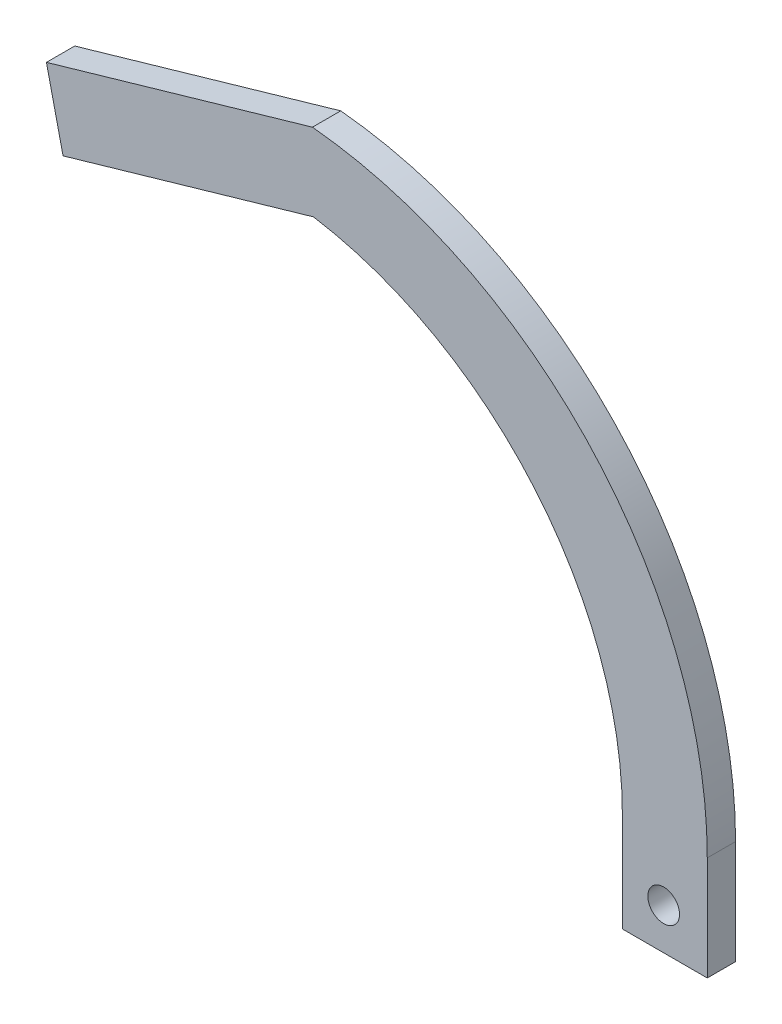
ISO-10303-21;
HEADER;
FILE_DESCRIPTION(('STEP AP214'),'2;1');
FILE_NAME('part.step','',(''),(''),'','','');
FILE_SCHEMA(('AUTOMOTIVE_DESIGN { 1 0 10303 214 1 1 1 1 }'));
ENDSEC;
DATA;
#1=APPLICATION_CONTEXT('core data for automotive mechanical design processes');
#2=APPLICATION_PROTOCOL_DEFINITION('international standard','automotive_design',2000,#1);
#3=PRODUCT_CONTEXT('',#1,'mechanical');
#4=PRODUCT('Part','Part','',(#3));
#5=PRODUCT_RELATED_PRODUCT_CATEGORY('part','',(#4));
#6=PRODUCT_DEFINITION_FORMATION('','',#4);
#7=PRODUCT_DEFINITION_CONTEXT('part definition',#1,'design');
#8=PRODUCT_DEFINITION('design','',#6,#7);
#9=PRODUCT_DEFINITION_SHAPE('','',#8);
#10=(LENGTH_UNIT() NAMED_UNIT(*) SI_UNIT(.MILLI.,.METRE.));
#11=(NAMED_UNIT(*) PLANE_ANGLE_UNIT() SI_UNIT($,.RADIAN.));
#12=(NAMED_UNIT(*) SI_UNIT($,.STERADIAN.) SOLID_ANGLE_UNIT());
#13=UNCERTAINTY_MEASURE_WITH_UNIT(LENGTH_MEASURE(1.E-05),#10,'distance_accuracy_value','');
#14=(GEOMETRIC_REPRESENTATION_CONTEXT(3) GLOBAL_UNCERTAINTY_ASSIGNED_CONTEXT((#13)) GLOBAL_UNIT_ASSIGNED_CONTEXT((#10,
#11,#12)) REPRESENTATION_CONTEXT('',''));
#15=CARTESIAN_POINT('',(0.,0.,0.));
#16=DIRECTION('',(0.,0.,1.));
#17=DIRECTION('',(1.,0.,0.));
#18=AXIS2_PLACEMENT_3D('',#15,#16,#17);
#19=CARTESIAN_POINT('',(-116.627264147549,44.7987217082872,2.54));
#20=DIRECTION('',(0.,0.,-1.));
#21=DIRECTION('',(-1.,0.,0.));
#22=AXIS2_PLACEMENT_3D('',#19,#20,#21);
#23=CYLINDRICAL_SURFACE('',#22,66.0594790028803);
#24=CARTESIAN_POINT('',(-116.627264147549,44.7987217082872,-2.54));
#25=DIRECTION('',(0.,0.,-1.));
#26=DIRECTION('',(1.,0.,0.));
#27=AXIS2_PLACEMENT_3D('',#24,#25,#26);
#28=CIRCLE('',#27,66.0594790028803);
#29=CARTESIAN_POINT('',(-106.007662429317,109.999019449004,-2.54));
#30=VERTEX_POINT('',#29);
#31=CARTESIAN_POINT('',(-50.5677851446684,44.7987217082872,-2.54));
#32=VERTEX_POINT('',#31);
#33=EDGE_CURVE('E128',#30,#32,#28,.T.);
#34=ORIENTED_EDGE('',*,*,#33,.T.);
#35=DIRECTION('',(0.,0.,-1.));
#36=VECTOR('',#35,1.);
#37=CARTESIAN_POINT('',(-50.5677851446684,44.7987217082872,2.54));
#38=LINE('',#37,#36);
#39=CARTESIAN_POINT('',(-50.5677851446684,44.7987217082872,2.54));
#40=VERTEX_POINT('',#39);
#41=EDGE_CURVE('E11',#40,#32,#38,.T.);
#42=ORIENTED_EDGE('',*,*,#41,.F.);
#43=CARTESIAN_POINT('',(-116.627264147549,44.7987217082872,2.54));
#44=DIRECTION('',(0.,0.,-1.));
#45=DIRECTION('',(1.,0.,0.));
#46=AXIS2_PLACEMENT_3D('',#43,#44,#45);
#47=CIRCLE('',#46,66.0594790028803);
#48=CARTESIAN_POINT('',(-106.007662429317,109.999019449004,2.54));
#49=VERTEX_POINT('',#48);
#50=EDGE_CURVE('E143',#49,#40,#47,.T.);
#51=ORIENTED_EDGE('',*,*,#50,.F.);
#52=DIRECTION('',(0.,0.,-1.));
#53=VECTOR('',#52,1.);
#54=CARTESIAN_POINT('',(-106.007662429317,109.999019449004,2.54));
#55=LINE('',#54,#53);
#56=EDGE_CURVE('E124',#49,#30,#55,.T.);
#57=ORIENTED_EDGE('',*,*,#56,.T.);
#58=EDGE_LOOP('',(#34,#42,#51,#57));
#59=FACE_BOUND('',#58,.T.);
#60=ADVANCED_FACE('F32',(#59),#23,.F.);
#61=CARTESIAN_POINT('',(-50.5677851446684,44.7987217082872,2.54));
#62=DIRECTION('',(1.,0.,0.));
#63=DIRECTION('',(0.,0.,-1.));
#64=AXIS2_PLACEMENT_3D('',#61,#62,#63);
#65=PLANE('',#64);
#66=DIRECTION('',(0.,-1.,0.));
#67=VECTOR('',#66,1.);
#68=CARTESIAN_POINT('',(-50.5677851446684,44.7987217082872,-2.54));
#69=LINE('',#68,#67);
#70=CARTESIAN_POINT('',(-50.5677851446684,27.0187217082872,-2.54));
#71=VERTEX_POINT('',#70);
#72=EDGE_CURVE('E131',#32,#71,#69,.T.);
#73=ORIENTED_EDGE('',*,*,#72,.T.);
#74=DIRECTION('',(0.,0.,-1.));
#75=VECTOR('',#74,1.);
#76=CARTESIAN_POINT('',(-50.5677851446684,27.0187217082872,2.54));
#77=LINE('',#76,#75);
#78=CARTESIAN_POINT('',(-50.5677851446684,27.0187217082872,2.54));
#79=VERTEX_POINT('',#78);
#80=EDGE_CURVE('E40',#79,#71,#77,.T.);
#81=ORIENTED_EDGE('',*,*,#80,.F.);
#82=DIRECTION('',(0.,-1.,0.));
#83=VECTOR('',#82,1.);
#84=CARTESIAN_POINT('',(-50.5677851446684,44.7987217082872,2.54));
#85=LINE('',#84,#83);
#86=EDGE_CURVE('E91',#40,#79,#85,.T.);
#87=ORIENTED_EDGE('',*,*,#86,.F.);
#88=ORIENTED_EDGE('',*,*,#41,.T.);
#89=EDGE_LOOP('',(#73,#81,#87,#88));
#90=FACE_BOUND('',#89,.T.);
#91=ADVANCED_FACE('F196',(#90),#65,.F.);
#92=CARTESIAN_POINT('',(-50.5677851446684,27.0187217082872,2.54));
#93=DIRECTION('',(0.,1.,0.));
#94=DIRECTION('',(-1.,0.,0.));
#95=AXIS2_PLACEMENT_3D('',#92,#93,#94);
#96=PLANE('',#95);
#97=DIRECTION('',(1.,0.,0.));
#98=VECTOR('',#97,1.);
#99=CARTESIAN_POINT('',(-50.5677851446684,27.0187217082872,-2.54));
#100=LINE('',#99,#98);
#101=CARTESIAN_POINT('',(-35.3277851446683,27.0187217082872,-2.54));
#102=VERTEX_POINT('',#101);
#103=EDGE_CURVE('E134',#71,#102,#100,.T.);
#104=ORIENTED_EDGE('',*,*,#103,.T.);
#105=DIRECTION('',(0.,0.,-1.));
#106=VECTOR('',#105,1.);
#107=CARTESIAN_POINT('',(-35.3277851446683,27.0187217082872,2.54));
#108=LINE('',#107,#106);
#109=CARTESIAN_POINT('',(-35.3277851446683,27.0187217082872,2.54));
#110=VERTEX_POINT('',#109);
#111=EDGE_CURVE('E150',#110,#102,#108,.T.);
#112=ORIENTED_EDGE('',*,*,#111,.F.);
#113=DIRECTION('',(1.,0.,0.));
#114=VECTOR('',#113,1.);
#115=CARTESIAN_POINT('',(-50.5677851446684,27.0187217082872,2.54));
#116=LINE('',#115,#114);
#117=EDGE_CURVE('E158',#79,#110,#116,.T.);
#118=ORIENTED_EDGE('',*,*,#117,.F.);
#119=ORIENTED_EDGE('',*,*,#80,.T.);
#120=EDGE_LOOP('',(#104,#112,#118,#119));
#121=FACE_BOUND('',#120,.T.);
#122=ADVANCED_FACE('F156',(#121),#96,.F.);
#123=CARTESIAN_POINT('',(-35.3277851446683,45.6916525978471,2.54));
#124=DIRECTION('',(-1.,0.,0.));
#125=DIRECTION('',(0.,0.,1.));
#126=AXIS2_PLACEMENT_3D('',#123,#124,#125);
#127=PLANE('',#126);
#128=DIRECTION('',(0.,1.,0.));
#129=VECTOR('',#128,1.);
#130=CARTESIAN_POINT('',(-35.3277851446683,45.6916525978471,-2.54));
#131=LINE('',#130,#129);
#132=CARTESIAN_POINT('',(-35.3277851446683,45.6916525978471,-2.54));
#133=VERTEX_POINT('',#132);
#134=EDGE_CURVE('E136',#102,#133,#131,.T.);
#135=ORIENTED_EDGE('',*,*,#134,.T.);
#136=DIRECTION('',(0.,0.,-1.));
#137=VECTOR('',#136,1.);
#138=CARTESIAN_POINT('',(-35.3277851446683,45.6916525978471,2.54));
#139=LINE('',#138,#137);
#140=CARTESIAN_POINT('',(-35.3277851446683,45.6916525978471,2.54));
#141=VERTEX_POINT('',#140);
#142=EDGE_CURVE('E147',#141,#133,#139,.T.);
#143=ORIENTED_EDGE('',*,*,#142,.F.);
#144=DIRECTION('',(0.,1.,0.));
#145=VECTOR('',#144,1.);
#146=CARTESIAN_POINT('',(-35.3277851446683,45.6916525978471,2.54));
#147=LINE('',#146,#145);
#148=EDGE_CURVE('E170',#110,#141,#147,.T.);
#149=ORIENTED_EDGE('',*,*,#148,.F.);
#150=ORIENTED_EDGE('',*,*,#111,.T.);
#151=EDGE_LOOP('',(#135,#143,#149,#150));
#152=FACE_BOUND('',#151,.T.);
#153=ADVANCED_FACE('F166',(#152),#127,.F.);
#154=CARTESIAN_POINT('',(-113.863218923311,45.6916525978471,2.54));
#155=DIRECTION('',(0.,0.,-1.));
#156=DIRECTION('',(-1.,0.,0.));
#157=AXIS2_PLACEMENT_3D('',#154,#155,#156);
#158=CYLINDRICAL_SURFACE('',#157,78.5354337786425);
#159=CARTESIAN_POINT('',(-113.863218923311,45.6916525978471,-2.54));
#160=DIRECTION('',(0.,0.,1.));
#161=DIRECTION('',(1.,0.,0.));
#162=AXIS2_PLACEMENT_3D('',#159,#160,#161);
#163=CIRCLE('',#162,78.5354337786425);
#164=CARTESIAN_POINT('',(-106.203198828143,123.852630399696,-2.54));
#165=VERTEX_POINT('',#164);
#166=EDGE_CURVE('E138',#133,#165,#163,.T.);
#167=ORIENTED_EDGE('',*,*,#166,.T.);
#168=DIRECTION('',(0.,0.,-1.));
#169=VECTOR('',#168,1.);
#170=CARTESIAN_POINT('',(-106.203198828143,123.852630399696,2.54));
#171=LINE('',#170,#169);
#172=CARTESIAN_POINT('',(-106.203198828143,123.852630399696,2.54));
#173=VERTEX_POINT('',#172);
#174=EDGE_CURVE('E119',#173,#165,#171,.T.);
#175=ORIENTED_EDGE('',*,*,#174,.F.);
#176=CARTESIAN_POINT('',(-113.863218923311,45.6916525978471,2.54));
#177=DIRECTION('',(0.,0.,1.));
#178=DIRECTION('',(1.,0.,0.));
#179=AXIS2_PLACEMENT_3D('',#176,#177,#178);
#180=CIRCLE('',#179,78.5354337786425);
#181=EDGE_CURVE('E110',#141,#173,#180,.T.);
#182=ORIENTED_EDGE('',*,*,#181,.F.);
#183=ORIENTED_EDGE('',*,*,#142,.T.);
#184=EDGE_LOOP('',(#167,#175,#182,#183));
#185=FACE_BOUND('',#184,.T.);
#186=ADVANCED_FACE('F169',(#185),#158,.T.);
#187=CARTESIAN_POINT('',(-106.203198828143,123.852630399696,2.54));
#188=DIRECTION('',(0.277590241332078,-0.960699566939217,0.));
#189=DIRECTION('',(0.960699566939217,0.277590241332078,0.));
#190=AXIS2_PLACEMENT_3D('',#187,#188,#189);
#191=PLANE('',#190);
#192=DIRECTION('',(-0.960699566939217,-0.277590241332078,0.));
#193=VECTOR('',#192,1.);
#194=CARTESIAN_POINT('',(-106.203198828143,123.852630399696,-2.54));
#195=LINE('',#194,#193);
#196=CARTESIAN_POINT('',(-153.95636253686,110.054547529204,-2.54));
#197=VERTEX_POINT('',#196);
#198=EDGE_CURVE('E118',#165,#197,#195,.T.);
#199=ORIENTED_EDGE('',*,*,#198,.T.);
#200=DIRECTION('',(0.,0.,-1.));
#201=VECTOR('',#200,1.);
#202=CARTESIAN_POINT('',(-153.95636253686,110.054547529204,2.54));
#203=LINE('',#202,#201);
#204=CARTESIAN_POINT('',(-153.95636253686,110.054547529204,2.54));
#205=VERTEX_POINT('',#204);
#206=EDGE_CURVE('E115',#205,#197,#203,.T.);
#207=ORIENTED_EDGE('',*,*,#206,.F.);
#208=DIRECTION('',(-0.960699566939217,-0.277590241332078,0.));
#209=VECTOR('',#208,1.);
#210=CARTESIAN_POINT('',(-106.203198828143,123.852630399696,2.54));
#211=LINE('',#210,#209);
#212=EDGE_CURVE('E104',#173,#205,#211,.T.);
#213=ORIENTED_EDGE('',*,*,#212,.F.);
#214=ORIENTED_EDGE('',*,*,#174,.T.);
#215=EDGE_LOOP('',(#199,#207,#213,#214));
#216=FACE_BOUND('',#215,.T.);
#217=ADVANCED_FACE('F116',(#216),#191,.F.);
#218=CARTESIAN_POINT('',(-150.972399127608,97.0066412476908,2.54));
#219=DIRECTION('',(0.974832779704421,0.222937326649785,0.));
#220=DIRECTION('',(-0.222937326649785,0.97483277970442,0.));
#221=AXIS2_PLACEMENT_3D('',#218,#219,#220);
#222=PLANE('',#221);
#223=DIRECTION('',(0.222937326649785,-0.97483277970442,0.));
#224=VECTOR('',#223,1.);
#225=CARTESIAN_POINT('',(-150.972399127608,97.0066412476908,-2.54));
#226=LINE('',#225,#224);
#227=CARTESIAN_POINT('',(-150.972399127608,97.0066412476908,-2.54));
#228=VERTEX_POINT('',#227);
#229=EDGE_CURVE('E77',#197,#228,#226,.T.);
#230=ORIENTED_EDGE('',*,*,#229,.T.);
#231=DIRECTION('',(0.,0.,-1.));
#232=VECTOR('',#231,1.);
#233=CARTESIAN_POINT('',(-150.972399127608,97.0066412476908,2.54));
#234=LINE('',#233,#232);
#235=CARTESIAN_POINT('',(-150.972399127608,97.0066412476908,2.54));
#236=VERTEX_POINT('',#235);
#237=EDGE_CURVE('E120',#236,#228,#234,.T.);
#238=ORIENTED_EDGE('',*,*,#237,.F.);
#239=DIRECTION('',(0.222937326649785,-0.97483277970442,0.));
#240=VECTOR('',#239,1.);
#241=CARTESIAN_POINT('',(-150.972399127608,97.0066412476908,2.54));
#242=LINE('',#241,#240);
#243=EDGE_CURVE('E108',#205,#236,#242,.T.);
#244=ORIENTED_EDGE('',*,*,#243,.F.);
#245=ORIENTED_EDGE('',*,*,#206,.T.);
#246=EDGE_LOOP('',(#230,#238,#244,#245));
#247=FACE_BOUND('',#246,.T.);
#248=ADVANCED_FACE('F122',(#247),#222,.F.);
#249=CARTESIAN_POINT('',(-106.007662429317,109.999019449004,2.54));
#250=DIRECTION('',(-0.277590241332078,0.960699566939217,0.));
#251=DIRECTION('',(-0.960699566939217,-0.277590241332078,0.));
#252=AXIS2_PLACEMENT_3D('',#249,#250,#251);
#253=PLANE('',#252);
#254=DIRECTION('',(0.960699566939217,0.277590241332078,0.));
#255=VECTOR('',#254,1.);
#256=CARTESIAN_POINT('',(-106.007662429317,109.999019449004,-2.54));
#257=LINE('',#256,#255);
#258=EDGE_CURVE('E83',#228,#30,#257,.T.);
#259=ORIENTED_EDGE('',*,*,#258,.T.);
#260=ORIENTED_EDGE('',*,*,#56,.F.);
#261=DIRECTION('',(0.960699566939217,0.277590241332078,0.));
#262=VECTOR('',#261,1.);
#263=CARTESIAN_POINT('',(-106.007662429317,109.999019449004,2.54));
#264=LINE('',#263,#262);
#265=EDGE_CURVE('E48',#236,#49,#264,.T.);
#266=ORIENTED_EDGE('',*,*,#265,.F.);
#267=ORIENTED_EDGE('',*,*,#237,.T.);
#268=EDGE_LOOP('',(#259,#260,#266,#267));
#269=FACE_BOUND('',#268,.T.);
#270=ADVANCED_FACE('F185',(#269),#253,.F.);
#271=CARTESIAN_POINT('',(-116.627264147549,44.7987217082872,2.54));
#272=DIRECTION('',(0.,0.,1.));
#273=DIRECTION('',(1.,0.,0.));
#274=AXIS2_PLACEMENT_3D('',#271,#272,#273);
#275=PLANE('',#274);
#276=CARTESIAN_POINT('',(-43.152202961565,34.4122443605378,2.54));
#277=DIRECTION('',(0.,0.,1.));
#278=DIRECTION('',(1.,0.,0.));
#279=AXIS2_PLACEMENT_3D('',#276,#277,#278);
#280=CIRCLE('',#279,2.8448);
#281=CARTESIAN_POINT('',(-40.307402961565,34.4122443605378,2.54));
#282=VERTEX_POINT('',#281);
#283=EDGE_CURVE('E178',#282,#282,#280,.T.);
#284=ORIENTED_EDGE('',*,*,#283,.F.);
#285=EDGE_LOOP('',(#284));
#286=FACE_BOUND('',#285,.T.);
#287=ORIENTED_EDGE('',*,*,#50,.T.);
#288=ORIENTED_EDGE('',*,*,#86,.T.);
#289=ORIENTED_EDGE('',*,*,#117,.T.);
#290=ORIENTED_EDGE('',*,*,#148,.T.);
#291=ORIENTED_EDGE('',*,*,#181,.T.);
#292=ORIENTED_EDGE('',*,*,#212,.T.);
#293=ORIENTED_EDGE('',*,*,#243,.T.);
#294=ORIENTED_EDGE('',*,*,#265,.T.);
#295=EDGE_LOOP('',(#287,#288,#289,#290,#291,#292,#293,#294));
#296=FACE_BOUND('',#295,.T.);
#297=ADVANCED_FACE('F106',(#286,#296),#275,.T.);
#298=CARTESIAN_POINT('',(-116.627264147549,44.7987217082872,-2.54));
#299=DIRECTION('',(0.,0.,1.));
#300=DIRECTION('',(1.,0.,0.));
#301=AXIS2_PLACEMENT_3D('',#298,#299,#300);
#302=PLANE('',#301);
#303=CARTESIAN_POINT('',(-43.152202961565,34.4122443605378,-2.54));
#304=DIRECTION('',(0.,0.,1.));
#305=DIRECTION('',(1.,0.,0.));
#306=AXIS2_PLACEMENT_3D('',#303,#304,#305);
#307=CIRCLE('',#306,2.8448);
#308=CARTESIAN_POINT('',(-40.307402961565,34.4122443605378,-2.54));
#309=VERTEX_POINT('',#308);
#310=EDGE_CURVE('E132',#309,#309,#307,.F.);
#311=ORIENTED_EDGE('',*,*,#310,.F.);
#312=EDGE_LOOP('',(#311));
#313=FACE_BOUND('',#312,.T.);
#314=ORIENTED_EDGE('',*,*,#33,.F.);
#315=ORIENTED_EDGE('',*,*,#258,.F.);
#316=ORIENTED_EDGE('',*,*,#229,.F.);
#317=ORIENTED_EDGE('',*,*,#198,.F.);
#318=ORIENTED_EDGE('',*,*,#166,.F.);
#319=ORIENTED_EDGE('',*,*,#134,.F.);
#320=ORIENTED_EDGE('',*,*,#103,.F.);
#321=ORIENTED_EDGE('',*,*,#72,.F.);
#322=EDGE_LOOP('',(#314,#315,#316,#317,#318,#319,#320,#321));
#323=FACE_BOUND('',#322,.T.);
#324=ADVANCED_FACE('F162',(#313,#323),#302,.F.);
#325=CARTESIAN_POINT('',(-43.152202961565,34.4122443605378,-10.586309484478));
#326=DIRECTION('',(0.,0.,1.));
#327=DIRECTION('',(1.,0.,0.));
#328=AXIS2_PLACEMENT_3D('',#325,#326,#327);
#329=CYLINDRICAL_SURFACE('',#328,2.8448);
#330=ORIENTED_EDGE('',*,*,#310,.T.);
#331=EDGE_LOOP('',(#330));
#332=FACE_BOUND('',#331,.T.);
#333=ORIENTED_EDGE('',*,*,#283,.T.);
#334=EDGE_LOOP('',(#333));
#335=FACE_BOUND('',#334,.T.);
#336=ADVANCED_FACE('F182',(#332,#335),#329,.F.);
#337=CLOSED_SHELL('',(#60,#91,#122,#153,#186,#217,#248,#270,#297,#324,#336));
#338=MANIFOLD_SOLID_BREP('B2',#337);
#339=ADVANCED_BREP_SHAPE_REPRESENTATION('',(#18,#338),#14);
#340=SHAPE_DEFINITION_REPRESENTATION(#9,#339);
ENDSEC;
END-ISO-10303-21;
